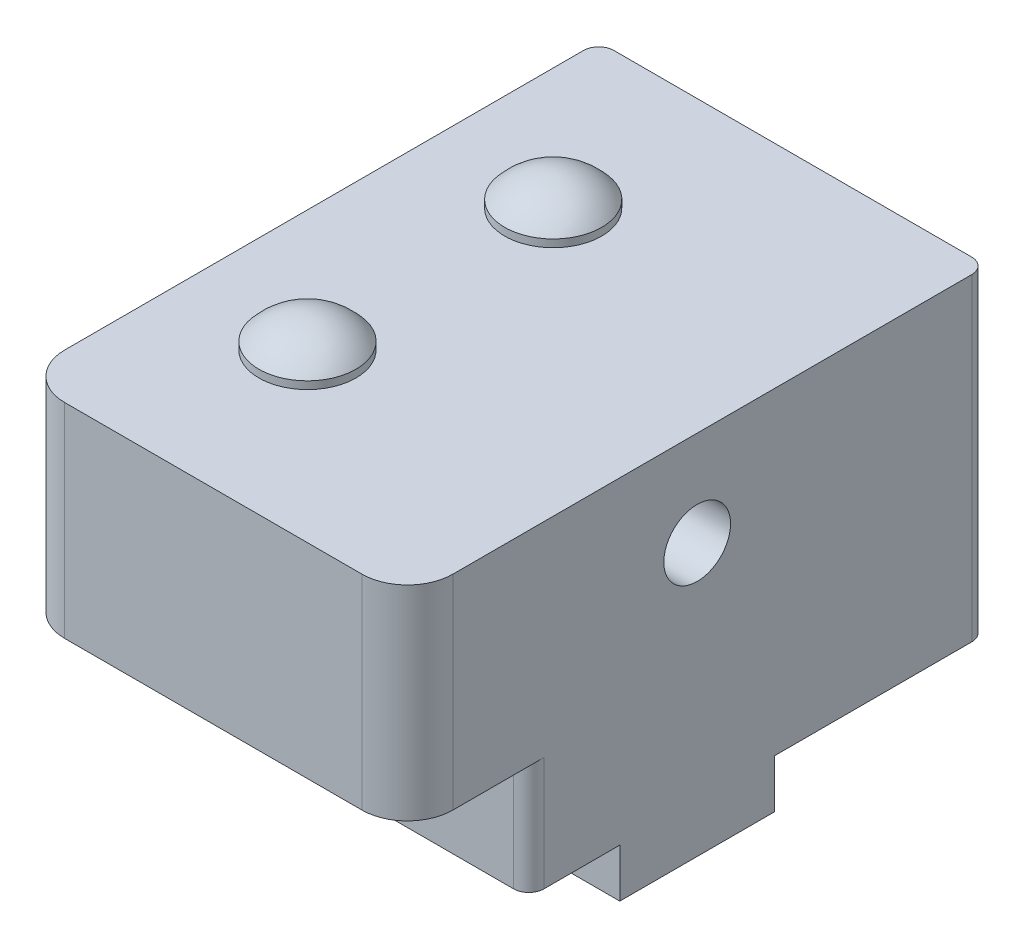
ISO-10303-21;
HEADER;
FILE_DESCRIPTION(('STEP AP214'),'2;1');
FILE_NAME('part.step','',(''),(''),'','','');
FILE_SCHEMA(('AUTOMOTIVE_DESIGN { 1 0 10303 214 1 1 1 1 }'));
ENDSEC;
DATA;
#1=APPLICATION_CONTEXT('core data for automotive mechanical design processes');
#2=APPLICATION_PROTOCOL_DEFINITION('international standard','automotive_design',2000,#1);
#3=PRODUCT_CONTEXT('',#1,'mechanical');
#4=PRODUCT('Part','Part','',(#3));
#5=PRODUCT_RELATED_PRODUCT_CATEGORY('part','',(#4));
#6=PRODUCT_DEFINITION_FORMATION('','',#4);
#7=PRODUCT_DEFINITION_CONTEXT('part definition',#1,'design');
#8=PRODUCT_DEFINITION('design','',#6,#7);
#9=PRODUCT_DEFINITION_SHAPE('','',#8);
#10=(LENGTH_UNIT() NAMED_UNIT(*) SI_UNIT(.MILLI.,.METRE.));
#11=(NAMED_UNIT(*) PLANE_ANGLE_UNIT() SI_UNIT($,.RADIAN.));
#12=(NAMED_UNIT(*) SI_UNIT($,.STERADIAN.) SOLID_ANGLE_UNIT());
#13=UNCERTAINTY_MEASURE_WITH_UNIT(LENGTH_MEASURE(1.E-05),#10,'distance_accuracy_value','');
#14=(GEOMETRIC_REPRESENTATION_CONTEXT(3) GLOBAL_UNCERTAINTY_ASSIGNED_CONTEXT((#13)) GLOBAL_UNIT_ASSIGNED_CONTEXT((#10,
#11,#12)) REPRESENTATION_CONTEXT('',''));
#15=CARTESIAN_POINT('',(0.,0.,0.));
#16=DIRECTION('',(0.,0.,1.));
#17=DIRECTION('',(1.,0.,0.));
#18=AXIS2_PLACEMENT_3D('',#15,#16,#17);
#19=CARTESIAN_POINT('',(3.,17.47,-33.2));
#20=DIRECTION('',(0.,0.,-1.));
#21=DIRECTION('',(-1.,0.,0.));
#22=AXIS2_PLACEMENT_3D('',#19,#20,#21);
#23=PLANE('',#22);
#24=CARTESIAN_POINT('',(3.,17.47,-33.2));
#25=DIRECTION('',(0.,0.,-1.));
#26=DIRECTION('',(-1.,0.,0.));
#27=AXIS2_PLACEMENT_3D('',#24,#25,#26);
#28=CIRCLE('',#27,1.25);
#29=CARTESIAN_POINT('',(1.75,17.47,-33.2));
#30=VERTEX_POINT('',#29);
#31=EDGE_CURVE('E20',#30,#30,#28,.T.);
#32=ORIENTED_EDGE('',*,*,#31,.T.);
#33=EDGE_LOOP('',(#32));
#34=FACE_BOUND('',#33,.T.);
#35=ADVANCED_FACE('F17',(#34),#23,.T.);
#36=CARTESIAN_POINT('',(3.,4.5,-33.2));
#37=DIRECTION('',(0.,0.,-1.));
#38=DIRECTION('',(-1.,0.,0.));
#39=AXIS2_PLACEMENT_3D('',#36,#37,#38);
#40=PLANE('',#39);
#41=CARTESIAN_POINT('',(3.,4.5,-33.2));
#42=DIRECTION('',(0.,0.,-1.));
#43=DIRECTION('',(-1.,0.,0.));
#44=AXIS2_PLACEMENT_3D('',#41,#42,#43);
#45=CIRCLE('',#44,1.25);
#46=CARTESIAN_POINT('',(1.75,4.5,-33.2));
#47=VERTEX_POINT('',#46);
#48=EDGE_CURVE('E398',#47,#47,#45,.T.);
#49=ORIENTED_EDGE('',*,*,#48,.T.);
#50=EDGE_LOOP('',(#49));
#51=FACE_BOUND('',#50,.T.);
#52=ADVANCED_FACE('F293',(#51),#40,.T.);
#53=CARTESIAN_POINT('',(22.59,17.47,-33.2));
#54=DIRECTION('',(0.,0.,-1.));
#55=DIRECTION('',(-1.,0.,0.));
#56=AXIS2_PLACEMENT_3D('',#53,#54,#55);
#57=PLANE('',#56);
#58=CARTESIAN_POINT('',(22.59,17.47,-33.2));
#59=DIRECTION('',(0.,0.,-1.));
#60=DIRECTION('',(-1.,0.,0.));
#61=AXIS2_PLACEMENT_3D('',#58,#59,#60);
#62=CIRCLE('',#61,1.25);
#63=CARTESIAN_POINT('',(21.34,17.47,-33.2));
#64=VERTEX_POINT('',#63);
#65=EDGE_CURVE('E399',#64,#64,#62,.T.);
#66=ORIENTED_EDGE('',*,*,#65,.T.);
#67=EDGE_LOOP('',(#66));
#68=FACE_BOUND('',#67,.T.);
#69=ADVANCED_FACE('F290',(#68),#57,.T.);
#70=CARTESIAN_POINT('',(22.59,4.5,-33.2));
#71=DIRECTION('',(0.,0.,-1.));
#72=DIRECTION('',(-1.,0.,0.));
#73=AXIS2_PLACEMENT_3D('',#70,#71,#72);
#74=PLANE('',#73);
#75=CARTESIAN_POINT('',(22.59,4.5,-33.2));
#76=DIRECTION('',(0.,0.,-1.));
#77=DIRECTION('',(-1.,0.,0.));
#78=AXIS2_PLACEMENT_3D('',#75,#76,#77);
#79=CIRCLE('',#78,1.25);
#80=CARTESIAN_POINT('',(21.34,4.5,-33.2));
#81=VERTEX_POINT('',#80);
#82=EDGE_CURVE('E120',#81,#81,#79,.T.);
#83=ORIENTED_EDGE('',*,*,#82,.T.);
#84=EDGE_LOOP('',(#83));
#85=FACE_BOUND('',#84,.T.);
#86=ADVANCED_FACE('F286',(#85),#74,.T.);
#87=CARTESIAN_POINT('',(0.,7.5,-8.));
#88=DIRECTION('',(0.,0.,-1.));
#89=DIRECTION('',(-1.,0.,0.));
#90=AXIS2_PLACEMENT_3D('',#87,#88,#89);
#91=PLANE('',#90);
#92=DIRECTION('',(0.,-1.,0.));
#93=VECTOR('',#92,1.);
#94=CARTESIAN_POINT('',(1.,7.5,-8.));
#95=LINE('',#94,#93);
#96=CARTESIAN_POINT('',(1.,0.,-8.));
#97=VERTEX_POINT('',#96);
#98=CARTESIAN_POINT('',(1.,7.5,-8.));
#99=VERTEX_POINT('',#98);
#100=EDGE_CURVE('E176',#97,#99,#95,.F.);
#101=ORIENTED_EDGE('',*,*,#100,.F.);
#102=DIRECTION('',(1.,0.,0.));
#103=VECTOR('',#102,1.);
#104=CARTESIAN_POINT('',(0.,0.,-8.));
#105=LINE('',#104,#103);
#106=CARTESIAN_POINT('',(24.59,0.,-8.));
#107=VERTEX_POINT('',#106);
#108=EDGE_CURVE('E173',#107,#97,#105,.F.);
#109=ORIENTED_EDGE('',*,*,#108,.F.);
#110=DIRECTION('',(0.,-1.,0.));
#111=VECTOR('',#110,1.);
#112=CARTESIAN_POINT('',(24.59,20.97,-8.));
#113=LINE('',#112,#111);
#114=CARTESIAN_POINT('',(24.59,7.5,-8.));
#115=VERTEX_POINT('',#114);
#116=EDGE_CURVE('E119',#115,#107,#113,.T.);
#117=ORIENTED_EDGE('',*,*,#116,.F.);
#118=DIRECTION('',(1.,0.,0.));
#119=VECTOR('',#118,1.);
#120=CARTESIAN_POINT('',(0.,7.5,-8.));
#121=LINE('',#120,#119);
#122=EDGE_CURVE('E200',#115,#99,#121,.F.);
#123=ORIENTED_EDGE('',*,*,#122,.T.);
#124=EDGE_LOOP('',(#101,#109,#117,#123));
#125=FACE_BOUND('',#124,.T.);
#126=ADVANCED_FACE('F282',(#125),#91,.F.);
#127=CARTESIAN_POINT('',(8.,18.8066666666667,-11.));
#128=DIRECTION('',(1.,0.,0.));
#129=DIRECTION('',(0.,0.,-1.));
#130=AXIS2_PLACEMENT_3D('',#127,#128,#129);
#131=SPHERICAL_SURFACE('',#130,4.16333333333333);
#132=CARTESIAN_POINT('',(8.,21.47,-11.));
#133=DIRECTION('',(0.,-1.,0.));
#134=DIRECTION('',(0.,0.,-1.));
#135=AXIS2_PLACEMENT_3D('',#132,#133,#134);
#136=CIRCLE('',#135,3.2);
#137=CARTESIAN_POINT('',(8.,21.47,-14.2));
#138=VERTEX_POINT('',#137);
#139=EDGE_CURVE('E416',#138,#138,#136,.T.);
#140=ORIENTED_EDGE('',*,*,#139,.F.);
#141=EDGE_LOOP('',(#140));
#142=FACE_BOUND('',#141,.T.);
#143=ADVANCED_FACE('F277',(#142),#131,.T.);
#144=CARTESIAN_POINT('',(8.,18.8066666666667,-27.2));
#145=DIRECTION('',(1.,0.,0.));
#146=DIRECTION('',(0.,0.,-1.));
#147=AXIS2_PLACEMENT_3D('',#144,#145,#146);
#148=SPHERICAL_SURFACE('',#147,4.16333333333333);
#149=CARTESIAN_POINT('',(8.,21.47,-27.2));
#150=DIRECTION('',(0.,-1.,0.));
#151=DIRECTION('',(0.,0.,-1.));
#152=AXIS2_PLACEMENT_3D('',#149,#150,#151);
#153=CIRCLE('',#152,3.2);
#154=CARTESIAN_POINT('',(8.,21.47,-30.4));
#155=VERTEX_POINT('',#154);
#156=EDGE_CURVE('E419',#155,#155,#153,.T.);
#157=ORIENTED_EDGE('',*,*,#156,.F.);
#158=EDGE_LOOP('',(#157));
#159=FACE_BOUND('',#158,.T.);
#160=ADVANCED_FACE('F272',(#159),#148,.T.);
#161=CARTESIAN_POINT('',(3.,17.47,-33.2));
#162=DIRECTION('',(0.,0.,-1.));
#163=DIRECTION('',(-1.,0.,0.));
#164=AXIS2_PLACEMENT_3D('',#161,#162,#163);
#165=CYLINDRICAL_SURFACE('',#164,1.25);
#166=CARTESIAN_POINT('',(3.,17.47,-38.2));
#167=DIRECTION('',(0.,0.,-1.));
#168=DIRECTION('',(-1.,0.,0.));
#169=AXIS2_PLACEMENT_3D('',#166,#167,#168);
#170=CIRCLE('',#169,1.25);
#171=CARTESIAN_POINT('',(1.75,17.47,-38.2));
#172=VERTEX_POINT('',#171);
#173=EDGE_CURVE('E422',#172,#172,#170,.T.);
#174=ORIENTED_EDGE('',*,*,#173,.T.);
#175=EDGE_LOOP('',(#174));
#176=FACE_BOUND('',#175,.T.);
#177=ORIENTED_EDGE('',*,*,#31,.F.);
#178=EDGE_LOOP('',(#177));
#179=FACE_BOUND('',#178,.T.);
#180=ADVANCED_FACE('F276',(#176,#179),#165,.F.);
#181=CARTESIAN_POINT('',(3.,4.5,-33.2));
#182=DIRECTION('',(0.,0.,-1.));
#183=DIRECTION('',(-1.,0.,0.));
#184=AXIS2_PLACEMENT_3D('',#181,#182,#183);
#185=CYLINDRICAL_SURFACE('',#184,1.25);
#186=CARTESIAN_POINT('',(3.,4.5,-38.2));
#187=DIRECTION('',(0.,0.,-1.));
#188=DIRECTION('',(-1.,0.,0.));
#189=AXIS2_PLACEMENT_3D('',#186,#187,#188);
#190=CIRCLE('',#189,1.25);
#191=CARTESIAN_POINT('',(1.75,4.5,-38.2));
#192=VERTEX_POINT('',#191);
#193=EDGE_CURVE('E396',#192,#192,#190,.T.);
#194=ORIENTED_EDGE('',*,*,#193,.T.);
#195=EDGE_LOOP('',(#194));
#196=FACE_BOUND('',#195,.T.);
#197=ORIENTED_EDGE('',*,*,#48,.F.);
#198=EDGE_LOOP('',(#197));
#199=FACE_BOUND('',#198,.T.);
#200=ADVANCED_FACE('F385',(#196,#199),#185,.F.);
#201=CARTESIAN_POINT('',(22.59,17.47,-33.2));
#202=DIRECTION('',(0.,0.,-1.));
#203=DIRECTION('',(-1.,0.,0.));
#204=AXIS2_PLACEMENT_3D('',#201,#202,#203);
#205=CYLINDRICAL_SURFACE('',#204,1.25);
#206=ORIENTED_EDGE('',*,*,#65,.F.);
#207=EDGE_LOOP('',(#206));
#208=FACE_BOUND('',#207,.T.);
#209=CARTESIAN_POINT('',(22.59,17.47,-38.2));
#210=DIRECTION('',(0.,0.,-1.));
#211=DIRECTION('',(-1.,0.,0.));
#212=AXIS2_PLACEMENT_3D('',#209,#210,#211);
#213=CIRCLE('',#212,1.25);
#214=CARTESIAN_POINT('',(21.34,17.47,-38.2));
#215=VERTEX_POINT('',#214);
#216=EDGE_CURVE('E426',#215,#215,#213,.T.);
#217=ORIENTED_EDGE('',*,*,#216,.T.);
#218=EDGE_LOOP('',(#217));
#219=FACE_BOUND('',#218,.T.);
#220=ADVANCED_FACE('F382',(#208,#219),#205,.F.);
#221=CARTESIAN_POINT('',(22.59,4.5,-33.2));
#222=DIRECTION('',(0.,0.,-1.));
#223=DIRECTION('',(-1.,0.,0.));
#224=AXIS2_PLACEMENT_3D('',#221,#222,#223);
#225=CYLINDRICAL_SURFACE('',#224,1.25);
#226=ORIENTED_EDGE('',*,*,#82,.F.);
#227=EDGE_LOOP('',(#226));
#228=FACE_BOUND('',#227,.T.);
#229=CARTESIAN_POINT('',(22.59,4.5,-38.2));
#230=DIRECTION('',(0.,0.,-1.));
#231=DIRECTION('',(-1.,0.,0.));
#232=AXIS2_PLACEMENT_3D('',#229,#230,#231);
#233=CIRCLE('',#232,1.25);
#234=CARTESIAN_POINT('',(21.34,4.5,-38.2));
#235=VERTEX_POINT('',#234);
#236=EDGE_CURVE('E172',#235,#235,#233,.T.);
#237=ORIENTED_EDGE('',*,*,#236,.T.);
#238=EDGE_LOOP('',(#237));
#239=FACE_BOUND('',#238,.T.);
#240=ADVANCED_FACE('F379',(#228,#239),#225,.F.);
#241=CARTESIAN_POINT('',(24.59,20.97,-37.2));
#242=DIRECTION('',(0.,-1.,0.));
#243=DIRECTION('',(0.,0.,-1.));
#244=AXIS2_PLACEMENT_3D('',#241,#242,#243);
#245=CYLINDRICAL_SURFACE('',#244,1.);
#246=CARTESIAN_POINT('',(24.59,0.,-37.2));
#247=DIRECTION('',(0.,-1.,0.));
#248=DIRECTION('',(0.,0.,-1.));
#249=AXIS2_PLACEMENT_3D('',#246,#247,#248);
#250=CIRCLE('',#249,1.);
#251=CARTESIAN_POINT('',(24.59,0.,-38.2));
#252=VERTEX_POINT('',#251);
#253=CARTESIAN_POINT('',(25.59,0.,-37.2));
#254=VERTEX_POINT('',#253);
#255=EDGE_CURVE('E213',#252,#254,#250,.T.);
#256=ORIENTED_EDGE('',*,*,#255,.F.);
#257=DIRECTION('',(0.,1.,0.));
#258=VECTOR('',#257,1.);
#259=CARTESIAN_POINT('',(24.59,20.97,-38.2));
#260=LINE('',#259,#258);
#261=CARTESIAN_POINT('',(24.59,20.97,-38.2));
#262=VERTEX_POINT('',#261);
#263=EDGE_CURVE('E117',#252,#262,#260,.T.);
#264=ORIENTED_EDGE('',*,*,#263,.T.);
#265=CARTESIAN_POINT('',(24.59,20.97,-37.2));
#266=DIRECTION('',(0.,-1.,0.));
#267=DIRECTION('',(0.,0.,-1.));
#268=AXIS2_PLACEMENT_3D('',#265,#266,#267);
#269=CIRCLE('',#268,1.);
#270=CARTESIAN_POINT('',(25.59,20.97,-37.2));
#271=VERTEX_POINT('',#270);
#272=EDGE_CURVE('E109',#262,#271,#269,.T.);
#273=ORIENTED_EDGE('',*,*,#272,.T.);
#274=DIRECTION('',(0.,1.,0.));
#275=VECTOR('',#274,1.);
#276=CARTESIAN_POINT('',(25.59,20.97,-37.2));
#277=LINE('',#276,#275);
#278=EDGE_CURVE('E116',#271,#254,#277,.F.);
#279=ORIENTED_EDGE('',*,*,#278,.T.);
#280=EDGE_LOOP('',(#256,#264,#273,#279));
#281=FACE_BOUND('',#280,.T.);
#282=ADVANCED_FACE('F115',(#281),#245,.T.);
#283=CARTESIAN_POINT('',(24.59,20.97,-9.));
#284=DIRECTION('',(0.,-1.,0.));
#285=DIRECTION('',(0.,0.,-1.));
#286=AXIS2_PLACEMENT_3D('',#283,#284,#285);
#287=CYLINDRICAL_SURFACE('',#286,1.);
#288=CARTESIAN_POINT('',(24.59,0.,-9.));
#289=DIRECTION('',(0.,-1.,0.));
#290=DIRECTION('',(0.,0.,-1.));
#291=AXIS2_PLACEMENT_3D('',#288,#289,#290);
#292=CIRCLE('',#291,1.);
#293=CARTESIAN_POINT('',(25.59,0.,-9.));
#294=VERTEX_POINT('',#293);
#295=EDGE_CURVE('E189',#294,#107,#292,.T.);
#296=ORIENTED_EDGE('',*,*,#295,.F.);
#297=DIRECTION('',(0.,1.,0.));
#298=VECTOR('',#297,1.);
#299=CARTESIAN_POINT('',(25.59,20.97,-9.));
#300=LINE('',#299,#298);
#301=CARTESIAN_POINT('',(25.59,7.5,-9.));
#302=VERTEX_POINT('',#301);
#303=EDGE_CURVE('E239',#294,#302,#300,.T.);
#304=ORIENTED_EDGE('',*,*,#303,.T.);
#305=CARTESIAN_POINT('',(24.59,7.5,-9.));
#306=DIRECTION('',(0.,-1.,0.));
#307=DIRECTION('',(0.,0.,-1.));
#308=AXIS2_PLACEMENT_3D('',#305,#306,#307);
#309=CIRCLE('',#308,1.);
#310=EDGE_CURVE('E203',#302,#115,#309,.T.);
#311=ORIENTED_EDGE('',*,*,#310,.T.);
#312=ORIENTED_EDGE('',*,*,#116,.T.);
#313=EDGE_LOOP('',(#296,#304,#311,#312));
#314=FACE_BOUND('',#313,.T.);
#315=ADVANCED_FACE('F372',(#314),#287,.T.);
#316=CARTESIAN_POINT('',(-6.22253967444162,14.7,-19.1));
#317=DIRECTION('',(1.,0.,0.));
#318=DIRECTION('',(0.,0.,-1.));
#319=AXIS2_PLACEMENT_3D('',#316,#317,#318);
#320=CYLINDRICAL_SURFACE('',#319,2.2);
#321=CARTESIAN_POINT('',(25.59,14.7,-19.1));
#322=DIRECTION('',(1.,0.,0.));
#323=DIRECTION('',(0.,0.,-1.));
#324=AXIS2_PLACEMENT_3D('',#321,#322,#323);
#325=CIRCLE('',#324,2.2);
#326=CARTESIAN_POINT('',(25.59,14.7,-21.3));
#327=VERTEX_POINT('',#326);
#328=EDGE_CURVE('E133',#327,#327,#325,.T.);
#329=ORIENTED_EDGE('',*,*,#328,.T.);
#330=EDGE_LOOP('',(#329));
#331=FACE_BOUND('',#330,.T.);
#332=CARTESIAN_POINT('',(0.,14.7,-19.1));
#333=DIRECTION('',(1.,0.,0.));
#334=DIRECTION('',(0.,0.,-1.));
#335=AXIS2_PLACEMENT_3D('',#332,#333,#334);
#336=CIRCLE('',#335,2.2);
#337=CARTESIAN_POINT('',(0.,14.7,-21.3));
#338=VERTEX_POINT('',#337);
#339=EDGE_CURVE('E158',#338,#338,#336,.F.);
#340=ORIENTED_EDGE('',*,*,#339,.T.);
#341=EDGE_LOOP('',(#340));
#342=FACE_BOUND('',#341,.T.);
#343=ADVANCED_FACE('F368',(#331,#342),#320,.F.);
#344=CARTESIAN_POINT('',(0.,-3.2,-14.));
#345=DIRECTION('',(0.,0.,-1.));
#346=DIRECTION('',(-1.,0.,0.));
#347=AXIS2_PLACEMENT_3D('',#344,#345,#346);
#348=PLANE('',#347);
#349=DIRECTION('',(0.,1.,0.));
#350=VECTOR('',#349,1.);
#351=CARTESIAN_POINT('',(0.,20.97,-14.));
#352=LINE('',#351,#350);
#353=CARTESIAN_POINT('',(0.,0.,-14.));
#354=VERTEX_POINT('',#353);
#355=CARTESIAN_POINT('',(0.,-3.2,-14.));
#356=VERTEX_POINT('',#355);
#357=EDGE_CURVE('E192',#354,#356,#352,.F.);
#358=ORIENTED_EDGE('',*,*,#357,.T.);
#359=DIRECTION('',(1.,0.,0.));
#360=VECTOR('',#359,1.);
#361=CARTESIAN_POINT('',(0.,-3.2,-14.));
#362=LINE('',#361,#360);
#363=CARTESIAN_POINT('',(25.59,-3.2,-14.));
#364=VERTEX_POINT('',#363);
#365=EDGE_CURVE('E223',#356,#364,#362,.T.);
#366=ORIENTED_EDGE('',*,*,#365,.T.);
#367=DIRECTION('',(0.,1.,0.));
#368=VECTOR('',#367,1.);
#369=CARTESIAN_POINT('',(25.59,20.97,-14.));
#370=LINE('',#369,#368);
#371=CARTESIAN_POINT('',(25.59,0.,-14.));
#372=VERTEX_POINT('',#371);
#373=EDGE_CURVE('E245',#364,#372,#370,.T.);
#374=ORIENTED_EDGE('',*,*,#373,.T.);
#375=DIRECTION('',(1.,0.,0.));
#376=VECTOR('',#375,1.);
#377=CARTESIAN_POINT('',(0.,0.,-14.));
#378=LINE('',#377,#376);
#379=EDGE_CURVE('E186',#354,#372,#378,.T.);
#380=ORIENTED_EDGE('',*,*,#379,.F.);
#381=EDGE_LOOP('',(#358,#366,#374,#380));
#382=FACE_BOUND('',#381,.T.);
#383=ADVANCED_FACE('F364',(#382),#348,.F.);
#384=CARTESIAN_POINT('',(0.,-3.2,0.));
#385=DIRECTION('',(0.,1.,0.));
#386=DIRECTION('',(0.,0.,1.));
#387=AXIS2_PLACEMENT_3D('',#384,#385,#386);
#388=PLANE('',#387);
#389=DIRECTION('',(0.,0.,-1.));
#390=VECTOR('',#389,1.);
#391=CARTESIAN_POINT('',(0.,-3.2,0.));
#392=LINE('',#391,#390);
#393=CARTESIAN_POINT('',(0.,-3.2,-24.2));
#394=VERTEX_POINT('',#393);
#395=EDGE_CURVE('E195',#356,#394,#392,.T.);
#396=ORIENTED_EDGE('',*,*,#395,.T.);
#397=DIRECTION('',(1.,0.,0.));
#398=VECTOR('',#397,1.);
#399=CARTESIAN_POINT('',(0.,-3.2,-24.2));
#400=LINE('',#399,#398);
#401=CARTESIAN_POINT('',(25.59,-3.2,-24.2));
#402=VERTEX_POINT('',#401);
#403=EDGE_CURVE('E220',#394,#402,#400,.T.);
#404=ORIENTED_EDGE('',*,*,#403,.T.);
#405=DIRECTION('',(0.,0.,1.));
#406=VECTOR('',#405,1.);
#407=CARTESIAN_POINT('',(25.59,-3.2,0.));
#408=LINE('',#407,#406);
#409=EDGE_CURVE('E250',#402,#364,#408,.T.);
#410=ORIENTED_EDGE('',*,*,#409,.T.);
#411=ORIENTED_EDGE('',*,*,#365,.F.);
#412=EDGE_LOOP('',(#396,#404,#410,#411));
#413=FACE_BOUND('',#412,.T.);
#414=ADVANCED_FACE('F360',(#413),#388,.F.);
#415=CARTESIAN_POINT('',(0.,-3.2,-24.2));
#416=DIRECTION('',(0.,0.,1.));
#417=DIRECTION('',(1.,0.,0.));
#418=AXIS2_PLACEMENT_3D('',#415,#416,#417);
#419=PLANE('',#418);
#420=DIRECTION('',(0.,1.,0.));
#421=VECTOR('',#420,1.);
#422=CARTESIAN_POINT('',(25.59,20.97,-24.2));
#423=LINE('',#422,#421);
#424=CARTESIAN_POINT('',(25.59,0.,-24.2));
#425=VERTEX_POINT('',#424);
#426=EDGE_CURVE('E255',#425,#402,#423,.F.);
#427=ORIENTED_EDGE('',*,*,#426,.T.);
#428=ORIENTED_EDGE('',*,*,#403,.F.);
#429=DIRECTION('',(0.,1.,0.));
#430=VECTOR('',#429,1.);
#431=CARTESIAN_POINT('',(0.,20.97,-24.2));
#432=LINE('',#431,#430);
#433=CARTESIAN_POINT('',(0.,0.,-24.2));
#434=VERTEX_POINT('',#433);
#435=EDGE_CURVE('E206',#394,#434,#432,.T.);
#436=ORIENTED_EDGE('',*,*,#435,.T.);
#437=DIRECTION('',(1.,0.,0.));
#438=VECTOR('',#437,1.);
#439=CARTESIAN_POINT('',(0.,0.,-24.2));
#440=LINE('',#439,#438);
#441=EDGE_CURVE('E209',#425,#434,#440,.F.);
#442=ORIENTED_EDGE('',*,*,#441,.F.);
#443=EDGE_LOOP('',(#427,#428,#436,#442));
#444=FACE_BOUND('',#443,.T.);
#445=ADVANCED_FACE('F356',(#444),#419,.F.);
#446=CARTESIAN_POINT('',(0.,0.,0.));
#447=DIRECTION('',(0.,-1.,0.));
#448=DIRECTION('',(0.,0.,-1.));
#449=AXIS2_PLACEMENT_3D('',#446,#447,#448);
#450=PLANE('',#449);
#451=DIRECTION('',(0.,0.,1.));
#452=VECTOR('',#451,1.);
#453=CARTESIAN_POINT('',(25.59,0.,0.));
#454=LINE('',#453,#452);
#455=EDGE_CURVE('E132',#254,#425,#454,.T.);
#456=ORIENTED_EDGE('',*,*,#455,.T.);
#457=ORIENTED_EDGE('',*,*,#441,.T.);
#458=DIRECTION('',(0.,0.,-1.));
#459=VECTOR('',#458,1.);
#460=CARTESIAN_POINT('',(0.,0.,0.));
#461=LINE('',#460,#459);
#462=CARTESIAN_POINT('',(0.,0.,-37.2));
#463=VERTEX_POINT('',#462);
#464=EDGE_CURVE('E155',#434,#463,#461,.T.);
#465=ORIENTED_EDGE('',*,*,#464,.T.);
#466=CARTESIAN_POINT('',(1.,0.,-37.2));
#467=DIRECTION('',(0.,-1.,0.));
#468=DIRECTION('',(0.,0.,-1.));
#469=AXIS2_PLACEMENT_3D('',#466,#467,#468);
#470=CIRCLE('',#469,1.);
#471=CARTESIAN_POINT('',(1.,0.,-38.2));
#472=VERTEX_POINT('',#471);
#473=EDGE_CURVE('E408',#472,#463,#470,.F.);
#474=ORIENTED_EDGE('',*,*,#473,.F.);
#475=DIRECTION('',(1.,0.,0.));
#476=VECTOR('',#475,1.);
#477=CARTESIAN_POINT('',(0.,0.,-38.2));
#478=LINE('',#477,#476);
#479=EDGE_CURVE('E170',#472,#252,#478,.T.);
#480=ORIENTED_EDGE('',*,*,#479,.T.);
#481=ORIENTED_EDGE('',*,*,#255,.T.);
#482=EDGE_LOOP('',(#456,#457,#465,#474,#480,#481));
#483=FACE_BOUND('',#482,.T.);
#484=ADVANCED_FACE('F352',(#483),#450,.T.);
#485=CARTESIAN_POINT('',(1.,20.97,-37.2));
#486=DIRECTION('',(0.,-1.,0.));
#487=DIRECTION('',(0.,0.,-1.));
#488=AXIS2_PLACEMENT_3D('',#485,#486,#487);
#489=CYLINDRICAL_SURFACE('',#488,1.);
#490=ORIENTED_EDGE('',*,*,#473,.T.);
#491=DIRECTION('',(0.,1.,0.));
#492=VECTOR('',#491,1.);
#493=CARTESIAN_POINT('',(0.,20.97,-37.2));
#494=LINE('',#493,#492);
#495=CARTESIAN_POINT('',(0.,20.97,-37.2));
#496=VERTEX_POINT('',#495);
#497=EDGE_CURVE('E152',#463,#496,#494,.T.);
#498=ORIENTED_EDGE('',*,*,#497,.T.);
#499=CARTESIAN_POINT('',(1.,20.97,-37.2));
#500=DIRECTION('',(0.,-1.,0.));
#501=DIRECTION('',(0.,0.,-1.));
#502=AXIS2_PLACEMENT_3D('',#499,#500,#501);
#503=CIRCLE('',#502,1.);
#504=CARTESIAN_POINT('',(1.,20.97,-38.2));
#505=VERTEX_POINT('',#504);
#506=EDGE_CURVE('E212',#496,#505,#503,.T.);
#507=ORIENTED_EDGE('',*,*,#506,.T.);
#508=DIRECTION('',(0.,1.,0.));
#509=VECTOR('',#508,1.);
#510=CARTESIAN_POINT('',(1.,20.97,-38.2));
#511=LINE('',#510,#509);
#512=EDGE_CURVE('E167',#505,#472,#511,.F.);
#513=ORIENTED_EDGE('',*,*,#512,.T.);
#514=EDGE_LOOP('',(#490,#498,#507,#513));
#515=FACE_BOUND('',#514,.T.);
#516=ADVANCED_FACE('F348',(#515),#489,.T.);
#517=CARTESIAN_POINT('',(0.,7.5,0.));
#518=DIRECTION('',(0.,1.,0.));
#519=DIRECTION('',(0.,0.,1.));
#520=AXIS2_PLACEMENT_3D('',#517,#518,#519);
#521=PLANE('',#520);
#522=DIRECTION('',(0.,0.,-1.));
#523=VECTOR('',#522,1.);
#524=CARTESIAN_POINT('',(0.,7.5,0.));
#525=LINE('',#524,#523);
#526=CARTESIAN_POINT('',(0.,7.5,-3.));
#527=VERTEX_POINT('',#526);
#528=CARTESIAN_POINT('',(0.,7.5,-9.));
#529=VERTEX_POINT('',#528);
#530=EDGE_CURVE('E151',#527,#529,#525,.T.);
#531=ORIENTED_EDGE('',*,*,#530,.T.);
#532=CARTESIAN_POINT('',(1.,7.5,-9.));
#533=DIRECTION('',(0.,-1.,0.));
#534=DIRECTION('',(0.,0.,-1.));
#535=AXIS2_PLACEMENT_3D('',#532,#533,#534);
#536=CIRCLE('',#535,1.);
#537=EDGE_CURVE('E202',#99,#529,#536,.T.);
#538=ORIENTED_EDGE('',*,*,#537,.F.);
#539=ORIENTED_EDGE('',*,*,#122,.F.);
#540=ORIENTED_EDGE('',*,*,#310,.F.);
#541=DIRECTION('',(0.,0.,1.));
#542=VECTOR('',#541,1.);
#543=CARTESIAN_POINT('',(25.59,7.5,0.));
#544=LINE('',#543,#542);
#545=CARTESIAN_POINT('',(25.59,7.5,-3.));
#546=VERTEX_POINT('',#545);
#547=EDGE_CURVE('E236',#302,#546,#544,.T.);
#548=ORIENTED_EDGE('',*,*,#547,.T.);
#549=CARTESIAN_POINT('',(22.59,7.5,-3.));
#550=DIRECTION('',(0.,-1.,0.));
#551=DIRECTION('',(0.,0.,-1.));
#552=AXIS2_PLACEMENT_3D('',#549,#550,#551);
#553=CIRCLE('',#552,3.);
#554=CARTESIAN_POINT('',(22.59,7.5,0.));
#555=VERTEX_POINT('',#554);
#556=EDGE_CURVE('E165',#555,#546,#553,.F.);
#557=ORIENTED_EDGE('',*,*,#556,.F.);
#558=DIRECTION('',(-1.,0.,0.));
#559=VECTOR('',#558,1.);
#560=CARTESIAN_POINT('',(0.,7.5,0.));
#561=LINE('',#560,#559);
#562=CARTESIAN_POINT('',(3.,7.5,0.));
#563=VERTEX_POINT('',#562);
#564=EDGE_CURVE('E163',#555,#563,#561,.T.);
#565=ORIENTED_EDGE('',*,*,#564,.T.);
#566=CARTESIAN_POINT('',(3.,7.5,-3.));
#567=DIRECTION('',(0.,-1.,0.));
#568=DIRECTION('',(0.,0.,-1.));
#569=AXIS2_PLACEMENT_3D('',#566,#567,#568);
#570=CIRCLE('',#569,3.);
#571=EDGE_CURVE('E159',#527,#563,#570,.F.);
#572=ORIENTED_EDGE('',*,*,#571,.F.);
#573=EDGE_LOOP('',(#531,#538,#539,#540,#548,#557,#565,#572));
#574=FACE_BOUND('',#573,.T.);
#575=ADVANCED_FACE('F344',(#574),#521,.F.);
#576=CARTESIAN_POINT('',(1.,7.5,-9.));
#577=DIRECTION('',(0.,-1.,0.));
#578=DIRECTION('',(0.,0.,-1.));
#579=AXIS2_PLACEMENT_3D('',#576,#577,#578);
#580=CYLINDRICAL_SURFACE('',#579,1.);
#581=CARTESIAN_POINT('',(1.,0.,-9.));
#582=DIRECTION('',(0.,-1.,0.));
#583=DIRECTION('',(0.,0.,-1.));
#584=AXIS2_PLACEMENT_3D('',#581,#582,#583);
#585=CIRCLE('',#584,1.);
#586=CARTESIAN_POINT('',(0.,0.,-9.));
#587=VERTEX_POINT('',#586);
#588=EDGE_CURVE('E175',#97,#587,#585,.T.);
#589=ORIENTED_EDGE('',*,*,#588,.F.);
#590=ORIENTED_EDGE('',*,*,#100,.T.);
#591=ORIENTED_EDGE('',*,*,#537,.T.);
#592=DIRECTION('',(0.,1.,0.));
#593=VECTOR('',#592,1.);
#594=CARTESIAN_POINT('',(0.,20.97,-9.));
#595=LINE('',#594,#593);
#596=EDGE_CURVE('E177',#529,#587,#595,.F.);
#597=ORIENTED_EDGE('',*,*,#596,.T.);
#598=EDGE_LOOP('',(#589,#590,#591,#597));
#599=FACE_BOUND('',#598,.T.);
#600=ADVANCED_FACE('F340',(#599),#580,.T.);
#601=CARTESIAN_POINT('',(0.,0.,0.));
#602=DIRECTION('',(0.,-1.,0.));
#603=DIRECTION('',(0.,0.,-1.));
#604=AXIS2_PLACEMENT_3D('',#601,#602,#603);
#605=PLANE('',#604);
#606=DIRECTION('',(0.,0.,1.));
#607=VECTOR('',#606,1.);
#608=CARTESIAN_POINT('',(25.59,0.,0.));
#609=LINE('',#608,#607);
#610=EDGE_CURVE('E242',#372,#294,#609,.T.);
#611=ORIENTED_EDGE('',*,*,#610,.T.);
#612=ORIENTED_EDGE('',*,*,#295,.T.);
#613=ORIENTED_EDGE('',*,*,#108,.T.);
#614=ORIENTED_EDGE('',*,*,#588,.T.);
#615=DIRECTION('',(0.,0.,-1.));
#616=VECTOR('',#615,1.);
#617=CARTESIAN_POINT('',(0.,0.,0.));
#618=LINE('',#617,#616);
#619=EDGE_CURVE('E180',#587,#354,#618,.T.);
#620=ORIENTED_EDGE('',*,*,#619,.T.);
#621=ORIENTED_EDGE('',*,*,#379,.T.);
#622=EDGE_LOOP('',(#611,#612,#613,#614,#620,#621));
#623=FACE_BOUND('',#622,.T.);
#624=ADVANCED_FACE('F336',(#623),#605,.T.);
#625=CARTESIAN_POINT('',(8.,21.47,-11.));
#626=DIRECTION('',(0.,-1.,0.));
#627=DIRECTION('',(0.,0.,-1.));
#628=AXIS2_PLACEMENT_3D('',#625,#626,#627);
#629=CYLINDRICAL_SURFACE('',#628,3.2);
#630=CARTESIAN_POINT('',(8.,20.97,-11.));
#631=DIRECTION('',(0.,-1.,0.));
#632=DIRECTION('',(0.,0.,-1.));
#633=AXIS2_PLACEMENT_3D('',#630,#631,#632);
#634=CIRCLE('',#633,3.2);
#635=CARTESIAN_POINT('',(8.,20.97,-14.2));
#636=VERTEX_POINT('',#635);
#637=EDGE_CURVE('E183',#636,#636,#634,.F.);
#638=ORIENTED_EDGE('',*,*,#637,.T.);
#639=EDGE_LOOP('',(#638));
#640=FACE_BOUND('',#639,.T.);
#641=ORIENTED_EDGE('',*,*,#139,.T.);
#642=EDGE_LOOP('',(#641));
#643=FACE_BOUND('',#642,.T.);
#644=ADVANCED_FACE('F332',(#640,#643),#629,.T.);
#645=CARTESIAN_POINT('',(8.,21.47,-27.2));
#646=DIRECTION('',(0.,-1.,0.));
#647=DIRECTION('',(0.,0.,-1.));
#648=AXIS2_PLACEMENT_3D('',#645,#646,#647);
#649=CYLINDRICAL_SURFACE('',#648,3.2);
#650=ORIENTED_EDGE('',*,*,#156,.T.);
#651=EDGE_LOOP('',(#650));
#652=FACE_BOUND('',#651,.T.);
#653=CARTESIAN_POINT('',(8.,20.97,-27.2));
#654=DIRECTION('',(0.,-1.,0.));
#655=DIRECTION('',(0.,0.,-1.));
#656=AXIS2_PLACEMENT_3D('',#653,#654,#655);
#657=CIRCLE('',#656,3.2);
#658=CARTESIAN_POINT('',(8.,20.97,-30.4));
#659=VERTEX_POINT('',#658);
#660=EDGE_CURVE('E146',#659,#659,#657,.F.);
#661=ORIENTED_EDGE('',*,*,#660,.T.);
#662=EDGE_LOOP('',(#661));
#663=FACE_BOUND('',#662,.T.);
#664=ADVANCED_FACE('F328',(#652,#663),#649,.T.);
#665=CARTESIAN_POINT('',(0.,20.97,-38.2));
#666=DIRECTION('',(0.,0.,1.));
#667=DIRECTION('',(1.,0.,0.));
#668=AXIS2_PLACEMENT_3D('',#665,#666,#667);
#669=PLANE('',#668);
#670=ORIENTED_EDGE('',*,*,#512,.F.);
#671=DIRECTION('',(1.,0.,0.));
#672=VECTOR('',#671,1.);
#673=CARTESIAN_POINT('',(0.,20.97,-38.2));
#674=LINE('',#673,#672);
#675=EDGE_CURVE('E142',#505,#262,#674,.T.);
#676=ORIENTED_EDGE('',*,*,#675,.T.);
#677=ORIENTED_EDGE('',*,*,#263,.F.);
#678=ORIENTED_EDGE('',*,*,#479,.F.);
#679=EDGE_LOOP('',(#670,#676,#677,#678));
#680=FACE_BOUND('',#679,.T.);
#681=ORIENTED_EDGE('',*,*,#236,.F.);
#682=EDGE_LOOP('',(#681));
#683=FACE_BOUND('',#682,.T.);
#684=ORIENTED_EDGE('',*,*,#216,.F.);
#685=EDGE_LOOP('',(#684));
#686=FACE_BOUND('',#685,.T.);
#687=ORIENTED_EDGE('',*,*,#193,.F.);
#688=EDGE_LOOP('',(#687));
#689=FACE_BOUND('',#688,.T.);
#690=ORIENTED_EDGE('',*,*,#173,.F.);
#691=EDGE_LOOP('',(#690));
#692=FACE_BOUND('',#691,.T.);
#693=ADVANCED_FACE('F325',(#680,#683,#686,#689,#692),#669,.F.);
#694=CARTESIAN_POINT('',(25.59,20.97,0.));
#695=DIRECTION('',(-1.,0.,0.));
#696=DIRECTION('',(0.,0.,1.));
#697=AXIS2_PLACEMENT_3D('',#694,#695,#696);
#698=PLANE('',#697);
#699=ORIENTED_EDGE('',*,*,#303,.F.);
#700=ORIENTED_EDGE('',*,*,#610,.F.);
#701=ORIENTED_EDGE('',*,*,#373,.F.);
#702=ORIENTED_EDGE('',*,*,#409,.F.);
#703=ORIENTED_EDGE('',*,*,#426,.F.);
#704=ORIENTED_EDGE('',*,*,#455,.F.);
#705=ORIENTED_EDGE('',*,*,#278,.F.);
#706=DIRECTION('',(0.,0.,-1.));
#707=VECTOR('',#706,1.);
#708=CARTESIAN_POINT('',(25.59,20.97,0.));
#709=LINE('',#708,#707);
#710=CARTESIAN_POINT('',(25.59,20.97,-3.));
#711=VERTEX_POINT('',#710);
#712=EDGE_CURVE('E129',#271,#711,#709,.F.);
#713=ORIENTED_EDGE('',*,*,#712,.T.);
#714=DIRECTION('',(0.,-1.,0.));
#715=VECTOR('',#714,1.);
#716=CARTESIAN_POINT('',(25.59,20.97,-3.));
#717=LINE('',#716,#715);
#718=EDGE_CURVE('E164',#546,#711,#717,.F.);
#719=ORIENTED_EDGE('',*,*,#718,.F.);
#720=ORIENTED_EDGE('',*,*,#547,.F.);
#721=EDGE_LOOP('',(#699,#700,#701,#702,#703,#704,#705,#713,#719,#720));
#722=FACE_BOUND('',#721,.T.);
#723=ORIENTED_EDGE('',*,*,#328,.F.);
#724=EDGE_LOOP('',(#723));
#725=FACE_BOUND('',#724,.T.);
#726=ADVANCED_FACE('F126',(#722,#725),#698,.F.);
#727=CARTESIAN_POINT('',(22.59,20.97,-3.));
#728=DIRECTION('',(0.,-1.,0.));
#729=DIRECTION('',(0.,0.,-1.));
#730=AXIS2_PLACEMENT_3D('',#727,#728,#729);
#731=CYLINDRICAL_SURFACE('',#730,3.);
#732=CARTESIAN_POINT('',(22.59,20.97,-3.));
#733=DIRECTION('',(0.,-1.,0.));
#734=DIRECTION('',(0.,0.,-1.));
#735=AXIS2_PLACEMENT_3D('',#732,#733,#734);
#736=CIRCLE('',#735,3.);
#737=CARTESIAN_POINT('',(22.59,20.97,0.));
#738=VERTEX_POINT('',#737);
#739=EDGE_CURVE('E141',#711,#738,#736,.T.);
#740=ORIENTED_EDGE('',*,*,#739,.T.);
#741=DIRECTION('',(0.,1.,0.));
#742=VECTOR('',#741,1.);
#743=CARTESIAN_POINT('',(22.59,20.97,0.));
#744=LINE('',#743,#742);
#745=EDGE_CURVE('E160',#738,#555,#744,.F.);
#746=ORIENTED_EDGE('',*,*,#745,.T.);
#747=ORIENTED_EDGE('',*,*,#556,.T.);
#748=ORIENTED_EDGE('',*,*,#718,.T.);
#749=EDGE_LOOP('',(#740,#746,#747,#748));
#750=FACE_BOUND('',#749,.T.);
#751=ADVANCED_FACE('F318',(#750),#731,.T.);
#752=CARTESIAN_POINT('',(0.,20.97,0.));
#753=DIRECTION('',(0.,0.,-1.));
#754=DIRECTION('',(-1.,0.,0.));
#755=AXIS2_PLACEMENT_3D('',#752,#753,#754);
#756=PLANE('',#755);
#757=ORIENTED_EDGE('',*,*,#564,.F.);
#758=ORIENTED_EDGE('',*,*,#745,.F.);
#759=DIRECTION('',(1.,0.,0.));
#760=VECTOR('',#759,1.);
#761=CARTESIAN_POINT('',(0.,20.97,0.));
#762=LINE('',#761,#760);
#763=CARTESIAN_POINT('',(3.,20.97,0.));
#764=VERTEX_POINT('',#763);
#765=EDGE_CURVE('E144',#738,#764,#762,.F.);
#766=ORIENTED_EDGE('',*,*,#765,.T.);
#767=DIRECTION('',(0.,-1.,0.));
#768=VECTOR('',#767,1.);
#769=CARTESIAN_POINT('',(3.,20.97,0.));
#770=LINE('',#769,#768);
#771=EDGE_CURVE('E156',#563,#764,#770,.F.);
#772=ORIENTED_EDGE('',*,*,#771,.F.);
#773=EDGE_LOOP('',(#757,#758,#766,#772));
#774=FACE_BOUND('',#773,.T.);
#775=ADVANCED_FACE('F314',(#774),#756,.F.);
#776=CARTESIAN_POINT('',(3.,20.97,-3.));
#777=DIRECTION('',(0.,-1.,0.));
#778=DIRECTION('',(0.,0.,-1.));
#779=AXIS2_PLACEMENT_3D('',#776,#777,#778);
#780=CYLINDRICAL_SURFACE('',#779,3.);
#781=CARTESIAN_POINT('',(3.,20.97,-3.));
#782=DIRECTION('',(0.,-1.,0.));
#783=DIRECTION('',(0.,0.,-1.));
#784=AXIS2_PLACEMENT_3D('',#781,#782,#783);
#785=CIRCLE('',#784,3.);
#786=CARTESIAN_POINT('',(0.,20.97,-3.));
#787=VERTEX_POINT('',#786);
#788=EDGE_CURVE('E26',#764,#787,#785,.T.);
#789=ORIENTED_EDGE('',*,*,#788,.T.);
#790=DIRECTION('',(0.,1.,0.));
#791=VECTOR('',#790,1.);
#792=CARTESIAN_POINT('',(0.,20.97,-3.));
#793=LINE('',#792,#791);
#794=EDGE_CURVE('E34',#787,#527,#793,.F.);
#795=ORIENTED_EDGE('',*,*,#794,.T.);
#796=ORIENTED_EDGE('',*,*,#571,.T.);
#797=ORIENTED_EDGE('',*,*,#771,.T.);
#798=EDGE_LOOP('',(#789,#795,#796,#797));
#799=FACE_BOUND('',#798,.T.);
#800=ADVANCED_FACE('F309',(#799),#780,.T.);
#801=CARTESIAN_POINT('',(0.,20.97,0.));
#802=DIRECTION('',(1.,0.,0.));
#803=DIRECTION('',(0.,0.,-1.));
#804=AXIS2_PLACEMENT_3D('',#801,#802,#803);
#805=PLANE('',#804);
#806=ORIENTED_EDGE('',*,*,#596,.F.);
#807=ORIENTED_EDGE('',*,*,#530,.F.);
#808=ORIENTED_EDGE('',*,*,#794,.F.);
#809=DIRECTION('',(0.,0.,-1.));
#810=VECTOR('',#809,1.);
#811=CARTESIAN_POINT('',(0.,20.97,0.));
#812=LINE('',#811,#810);
#813=EDGE_CURVE('E11',#787,#496,#812,.T.);
#814=ORIENTED_EDGE('',*,*,#813,.T.);
#815=ORIENTED_EDGE('',*,*,#497,.F.);
#816=ORIENTED_EDGE('',*,*,#464,.F.);
#817=ORIENTED_EDGE('',*,*,#435,.F.);
#818=ORIENTED_EDGE('',*,*,#395,.F.);
#819=ORIENTED_EDGE('',*,*,#357,.F.);
#820=ORIENTED_EDGE('',*,*,#619,.F.);
#821=EDGE_LOOP('',(#806,#807,#808,#814,#815,#816,#817,#818,#819,#820));
#822=FACE_BOUND('',#821,.T.);
#823=ORIENTED_EDGE('',*,*,#339,.F.);
#824=EDGE_LOOP('',(#823));
#825=FACE_BOUND('',#824,.T.);
#826=ADVANCED_FACE('F304',(#822,#825),#805,.F.);
#827=CARTESIAN_POINT('',(0.,20.97,0.));
#828=DIRECTION('',(0.,-1.,0.));
#829=DIRECTION('',(0.,0.,-1.));
#830=AXIS2_PLACEMENT_3D('',#827,#828,#829);
#831=PLANE('',#830);
#832=ORIENTED_EDGE('',*,*,#788,.F.);
#833=ORIENTED_EDGE('',*,*,#765,.F.);
#834=ORIENTED_EDGE('',*,*,#739,.F.);
#835=ORIENTED_EDGE('',*,*,#712,.F.);
#836=ORIENTED_EDGE('',*,*,#272,.F.);
#837=ORIENTED_EDGE('',*,*,#675,.F.);
#838=ORIENTED_EDGE('',*,*,#506,.F.);
#839=ORIENTED_EDGE('',*,*,#813,.F.);
#840=EDGE_LOOP('',(#832,#833,#834,#835,#836,#837,#838,#839));
#841=FACE_BOUND('',#840,.T.);
#842=ORIENTED_EDGE('',*,*,#660,.F.);
#843=EDGE_LOOP('',(#842));
#844=FACE_BOUND('',#843,.T.);
#845=ORIENTED_EDGE('',*,*,#637,.F.);
#846=EDGE_LOOP('',(#845));
#847=FACE_BOUND('',#846,.T.);
#848=ADVANCED_FACE('F137',(#841,#844,#847),#831,.F.);
#849=CLOSED_SHELL('',(#35,#52,#69,#86,#126,#143,#160,#180,#200,#220,#240,#282,#315,#343,#383,
#414,#445,#484,#516,#575,#600,#624,#644,#664,#693,#726,#751,#775,#800,#826,#848));
#850=MANIFOLD_SOLID_BREP('B1',#849);
#851=ADVANCED_BREP_SHAPE_REPRESENTATION('',(#18,#850),#14);
#852=SHAPE_DEFINITION_REPRESENTATION(#9,#851);
ENDSEC;
END-ISO-10303-21;
